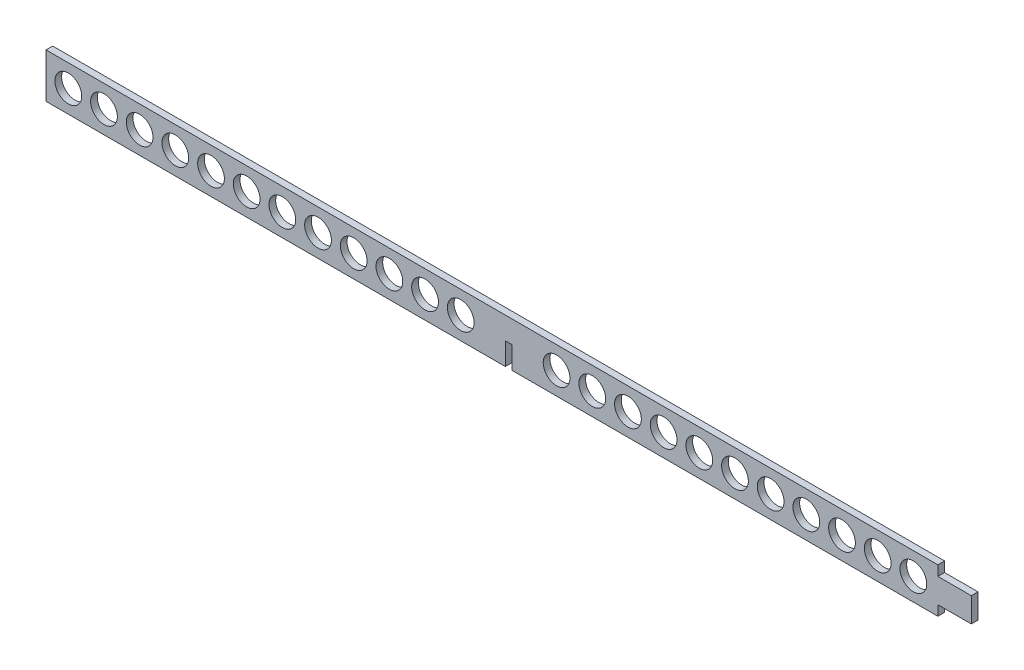
ISO-10303-21;
HEADER;
FILE_DESCRIPTION(('STEP AP214'),'2;1');
FILE_NAME('part.step','',(''),(''),'','','');
FILE_SCHEMA(('AUTOMOTIVE_DESIGN { 1 0 10303 214 1 1 1 1 }'));
ENDSEC;
DATA;
#1=APPLICATION_CONTEXT('core data for automotive mechanical design processes');
#2=APPLICATION_PROTOCOL_DEFINITION('international standard','automotive_design',2000,#1);
#3=PRODUCT_CONTEXT('',#1,'mechanical');
#4=PRODUCT('Part','Part','',(#3));
#5=PRODUCT_RELATED_PRODUCT_CATEGORY('part','',(#4));
#6=PRODUCT_DEFINITION_FORMATION('','',#4);
#7=PRODUCT_DEFINITION_CONTEXT('part definition',#1,'design');
#8=PRODUCT_DEFINITION('design','',#6,#7);
#9=PRODUCT_DEFINITION_SHAPE('','',#8);
#10=(LENGTH_UNIT() NAMED_UNIT(*) SI_UNIT(.MILLI.,.METRE.));
#11=(NAMED_UNIT(*) PLANE_ANGLE_UNIT() SI_UNIT($,.RADIAN.));
#12=(NAMED_UNIT(*) SI_UNIT($,.STERADIAN.) SOLID_ANGLE_UNIT());
#13=UNCERTAINTY_MEASURE_WITH_UNIT(LENGTH_MEASURE(1.E-05),#10,'distance_accuracy_value','');
#14=(GEOMETRIC_REPRESENTATION_CONTEXT(3) GLOBAL_UNCERTAINTY_ASSIGNED_CONTEXT((#13)) GLOBAL_UNIT_ASSIGNED_CONTEXT((#10,
#11,#12)) REPRESENTATION_CONTEXT('',''));
#15=CARTESIAN_POINT('',(0.,0.,0.));
#16=DIRECTION('',(0.,0.,1.));
#17=DIRECTION('',(1.,0.,0.));
#18=AXIS2_PLACEMENT_3D('',#15,#16,#17);
#19=CARTESIAN_POINT('',(0.,0.,3.));
#20=DIRECTION('',(0.,1.,0.));
#21=DIRECTION('',(-1.,0.,0.));
#22=AXIS2_PLACEMENT_3D('',#19,#20,#21);
#23=PLANE('',#22);
#24=DIRECTION('',(1.,0.,0.));
#25=VECTOR('',#24,1.);
#26=CARTESIAN_POINT('',(0.,0.,0.));
#27=LINE('',#26,#25);
#28=CARTESIAN_POINT('',(-415.,0.,0.));
#29=VERTEX_POINT('',#28);
#30=CARTESIAN_POINT('',(-209.,0.,0.));
#31=VERTEX_POINT('',#30);
#32=EDGE_CURVE('E176',#29,#31,#27,.T.);
#33=ORIENTED_EDGE('',*,*,#32,.T.);
#34=DIRECTION('',(0.,0.,1.));
#35=VECTOR('',#34,1.);
#36=CARTESIAN_POINT('',(-209.,0.,0.));
#37=LINE('',#36,#35);
#38=CARTESIAN_POINT('',(-209.,0.,3.));
#39=VERTEX_POINT('',#38);
#40=EDGE_CURVE('E313',#31,#39,#37,.T.);
#41=ORIENTED_EDGE('',*,*,#40,.T.);
#42=DIRECTION('',(1.,0.,0.));
#43=VECTOR('',#42,1.);
#44=CARTESIAN_POINT('',(0.,0.,3.));
#45=LINE('',#44,#43);
#46=CARTESIAN_POINT('',(-415.,0.,3.));
#47=VERTEX_POINT('',#46);
#48=EDGE_CURVE('E170',#47,#39,#45,.T.);
#49=ORIENTED_EDGE('',*,*,#48,.F.);
#50=DIRECTION('',(0.,0.,-1.));
#51=VECTOR('',#50,1.);
#52=CARTESIAN_POINT('',(-415.,0.,3.));
#53=LINE('',#52,#51);
#54=EDGE_CURVE('E52',#47,#29,#53,.T.);
#55=ORIENTED_EDGE('',*,*,#54,.T.);
#56=EDGE_LOOP('',(#33,#41,#49,#55));
#57=FACE_BOUND('',#56,.T.);
#58=ADVANCED_FACE('F43',(#57),#23,.F.);
#59=CARTESIAN_POINT('',(0.,0.,3.));
#60=DIRECTION('',(-1.,0.,0.));
#61=DIRECTION('',(0.,0.,1.));
#62=AXIS2_PLACEMENT_3D('',#59,#60,#61);
#63=PLANE('',#62);
#64=DIRECTION('',(0.,1.,0.));
#65=VECTOR('',#64,1.);
#66=CARTESIAN_POINT('',(0.,0.,0.));
#67=LINE('',#66,#65);
#68=CARTESIAN_POINT('',(0.,4.5,0.));
#69=VERTEX_POINT('',#68);
#70=CARTESIAN_POINT('',(0.,15.5,0.));
#71=VERTEX_POINT('',#70);
#72=EDGE_CURVE('E150',#69,#71,#67,.T.);
#73=ORIENTED_EDGE('',*,*,#72,.T.);
#74=DIRECTION('',(0.,0.,1.));
#75=VECTOR('',#74,1.);
#76=CARTESIAN_POINT('',(0.,15.5,0.));
#77=LINE('',#76,#75);
#78=CARTESIAN_POINT('',(0.,15.5,3.));
#79=VERTEX_POINT('',#78);
#80=EDGE_CURVE('E133',#71,#79,#77,.T.);
#81=ORIENTED_EDGE('',*,*,#80,.T.);
#82=DIRECTION('',(0.,1.,0.));
#83=VECTOR('',#82,1.);
#84=CARTESIAN_POINT('',(0.,0.,3.));
#85=LINE('',#84,#83);
#86=CARTESIAN_POINT('',(0.,4.5,3.));
#87=VERTEX_POINT('',#86);
#88=EDGE_CURVE('E179',#87,#79,#85,.T.);
#89=ORIENTED_EDGE('',*,*,#88,.F.);
#90=DIRECTION('',(0.,0.,1.));
#91=VECTOR('',#90,1.);
#92=CARTESIAN_POINT('',(0.,4.5,0.));
#93=LINE('',#92,#91);
#94=EDGE_CURVE('E157',#69,#87,#93,.T.);
#95=ORIENTED_EDGE('',*,*,#94,.F.);
#96=EDGE_LOOP('',(#73,#81,#89,#95));
#97=FACE_BOUND('',#96,.T.);
#98=ADVANCED_FACE('F45',(#97),#63,.F.);
#99=CARTESIAN_POINT('',(0.,20.,3.));
#100=DIRECTION('',(0.,-1.,0.));
#101=DIRECTION('',(1.,0.,0.));
#102=AXIS2_PLACEMENT_3D('',#99,#100,#101);
#103=PLANE('',#102);
#104=DIRECTION('',(-1.,0.,0.));
#105=VECTOR('',#104,1.);
#106=CARTESIAN_POINT('',(0.,20.,3.));
#107=LINE('',#106,#105);
#108=CARTESIAN_POINT('',(-15.,20.,3.));
#109=VERTEX_POINT('',#108);
#110=CARTESIAN_POINT('',(-415.,19.9999999999999,3.));
#111=VERTEX_POINT('',#110);
#112=EDGE_CURVE('E198',#109,#111,#107,.T.);
#113=ORIENTED_EDGE('',*,*,#112,.F.);
#114=DIRECTION('',(0.,0.,1.));
#115=VECTOR('',#114,1.);
#116=CARTESIAN_POINT('',(-15.,20.,0.));
#117=LINE('',#116,#115);
#118=CARTESIAN_POINT('',(-15.,20.,0.));
#119=VERTEX_POINT('',#118);
#120=EDGE_CURVE('E154',#119,#109,#117,.T.);
#121=ORIENTED_EDGE('',*,*,#120,.F.);
#122=DIRECTION('',(-1.,0.,0.));
#123=VECTOR('',#122,1.);
#124=CARTESIAN_POINT('',(0.,20.,0.));
#125=LINE('',#124,#123);
#126=CARTESIAN_POINT('',(-415.,19.9999999999999,0.));
#127=VERTEX_POINT('',#126);
#128=EDGE_CURVE('E159',#119,#127,#125,.T.);
#129=ORIENTED_EDGE('',*,*,#128,.T.);
#130=DIRECTION('',(0.,0.,-1.));
#131=VECTOR('',#130,1.);
#132=CARTESIAN_POINT('',(-415.,19.9999999999999,3.));
#133=LINE('',#132,#131);
#134=EDGE_CURVE('E11',#111,#127,#133,.T.);
#135=ORIENTED_EDGE('',*,*,#134,.F.);
#136=EDGE_LOOP('',(#113,#121,#129,#135));
#137=FACE_BOUND('',#136,.T.);
#138=ADVANCED_FACE('F475',(#137),#103,.F.);
#139=CARTESIAN_POINT('',(-415.,0.,3.));
#140=DIRECTION('',(1.,0.,0.));
#141=DIRECTION('',(0.,0.,-1.));
#142=AXIS2_PLACEMENT_3D('',#139,#140,#141);
#143=PLANE('',#142);
#144=DIRECTION('',(0.,-1.,0.));
#145=VECTOR('',#144,1.);
#146=CARTESIAN_POINT('',(-415.,0.,0.));
#147=LINE('',#146,#145);
#148=EDGE_CURVE('E164',#127,#29,#147,.T.);
#149=ORIENTED_EDGE('',*,*,#148,.T.);
#150=ORIENTED_EDGE('',*,*,#54,.F.);
#151=DIRECTION('',(0.,-1.,0.));
#152=VECTOR('',#151,1.);
#153=CARTESIAN_POINT('',(-415.,0.,3.));
#154=LINE('',#153,#152);
#155=EDGE_CURVE('E193',#111,#47,#154,.T.);
#156=ORIENTED_EDGE('',*,*,#155,.F.);
#157=ORIENTED_EDGE('',*,*,#134,.T.);
#158=EDGE_LOOP('',(#149,#150,#156,#157));
#159=FACE_BOUND('',#158,.T.);
#160=ADVANCED_FACE('F480',(#159),#143,.F.);
#161=CARTESIAN_POINT('',(-206.,0.,0.));
#162=VERTEX_POINT('',#161);
#163=CARTESIAN_POINT('',(-15.,0.,0.));
#164=VERTEX_POINT('',#163);
#165=EDGE_CURVE('E175',#162,#164,#27,.T.);
#166=ORIENTED_EDGE('',*,*,#165,.T.);
#167=DIRECTION('',(0.,0.,1.));
#168=VECTOR('',#167,1.);
#169=CARTESIAN_POINT('',(-15.,0.,0.));
#170=LINE('',#169,#168);
#171=CARTESIAN_POINT('',(-15.,0.,3.));
#172=VERTEX_POINT('',#171);
#173=EDGE_CURVE('E345',#164,#172,#170,.T.);
#174=ORIENTED_EDGE('',*,*,#173,.T.);
#175=CARTESIAN_POINT('',(-206.,0.,3.));
#176=VERTEX_POINT('',#175);
#177=EDGE_CURVE('E188',#176,#172,#45,.T.);
#178=ORIENTED_EDGE('',*,*,#177,.F.);
#179=DIRECTION('',(0.,0.,1.));
#180=VECTOR('',#179,1.);
#181=CARTESIAN_POINT('',(-206.,0.,0.));
#182=LINE('',#181,#180);
#183=EDGE_CURVE('E317',#162,#176,#182,.T.);
#184=ORIENTED_EDGE('',*,*,#183,.F.);
#185=EDGE_LOOP('',(#166,#174,#178,#184));
#186=FACE_BOUND('',#185,.T.);
#187=ADVANCED_FACE('F471',(#186),#23,.F.);
#188=CARTESIAN_POINT('',(0.,0.,3.));
#189=DIRECTION('',(0.,0.,1.));
#190=DIRECTION('',(1.,0.,0.));
#191=AXIS2_PLACEMENT_3D('',#188,#189,#190);
#192=PLANE('',#191);
#193=CARTESIAN_POINT('',(-42.,9.99999999999995,3.));
#194=DIRECTION('',(0.,0.,1.));
#195=DIRECTION('',(1.,0.,0.));
#196=AXIS2_PLACEMENT_3D('',#193,#194,#195);
#197=CIRCLE('',#196,5.99999999999999);
#198=CARTESIAN_POINT('',(-36.,9.99999999999995,3.));
#199=VERTEX_POINT('',#198);
#200=EDGE_CURVE('E160',#199,#199,#197,.T.);
#201=ORIENTED_EDGE('',*,*,#200,.F.);
#202=EDGE_LOOP('',(#201));
#203=FACE_BOUND('',#202,.T.);
#204=CARTESIAN_POINT('',(-26.,9.99999999999995,3.));
#205=DIRECTION('',(0.,0.,1.));
#206=DIRECTION('',(1.,0.,0.));
#207=AXIS2_PLACEMENT_3D('',#204,#205,#206);
#208=CIRCLE('',#207,5.99999999999999);
#209=CARTESIAN_POINT('',(-20.,9.99999999999995,3.));
#210=VERTEX_POINT('',#209);
#211=EDGE_CURVE('E167',#210,#210,#208,.T.);
#212=ORIENTED_EDGE('',*,*,#211,.F.);
#213=EDGE_LOOP('',(#212));
#214=FACE_BOUND('',#213,.T.);
#215=CARTESIAN_POINT('',(-229.,9.99999999999997,3.));
#216=DIRECTION('',(0.,0.,1.));
#217=DIRECTION('',(1.,0.,0.));
#218=AXIS2_PLACEMENT_3D('',#215,#216,#217);
#219=CIRCLE('',#218,5.99999999999999);
#220=CARTESIAN_POINT('',(-223.,9.99999999999997,3.));
#221=VERTEX_POINT('',#220);
#222=EDGE_CURVE('E208',#221,#221,#219,.T.);
#223=ORIENTED_EDGE('',*,*,#222,.F.);
#224=EDGE_LOOP('',(#223));
#225=FACE_BOUND('',#224,.T.);
#226=CARTESIAN_POINT('',(-245.,9.99999999999997,3.));
#227=DIRECTION('',(0.,0.,1.));
#228=DIRECTION('',(1.,0.,0.));
#229=AXIS2_PLACEMENT_3D('',#226,#227,#228);
#230=CIRCLE('',#229,5.99999999999999);
#231=CARTESIAN_POINT('',(-239.,9.99999999999997,3.));
#232=VERTEX_POINT('',#231);
#233=EDGE_CURVE('E212',#232,#232,#230,.T.);
#234=ORIENTED_EDGE('',*,*,#233,.F.);
#235=EDGE_LOOP('',(#234));
#236=FACE_BOUND('',#235,.T.);
#237=CARTESIAN_POINT('',(-261.,9.99999999999997,3.));
#238=DIRECTION('',(0.,0.,1.));
#239=DIRECTION('',(1.,0.,0.));
#240=AXIS2_PLACEMENT_3D('',#237,#238,#239);
#241=CIRCLE('',#240,5.99999999999999);
#242=CARTESIAN_POINT('',(-255.,9.99999999999997,3.));
#243=VERTEX_POINT('',#242);
#244=EDGE_CURVE('E216',#243,#243,#241,.T.);
#245=ORIENTED_EDGE('',*,*,#244,.F.);
#246=EDGE_LOOP('',(#245));
#247=FACE_BOUND('',#246,.T.);
#248=CARTESIAN_POINT('',(-277.,9.99999999999997,3.));
#249=DIRECTION('',(0.,0.,1.));
#250=DIRECTION('',(1.,0.,0.));
#251=AXIS2_PLACEMENT_3D('',#248,#249,#250);
#252=CIRCLE('',#251,5.99999999999999);
#253=CARTESIAN_POINT('',(-271.,9.99999999999997,3.));
#254=VERTEX_POINT('',#253);
#255=EDGE_CURVE('E220',#254,#254,#252,.T.);
#256=ORIENTED_EDGE('',*,*,#255,.F.);
#257=EDGE_LOOP('',(#256));
#258=FACE_BOUND('',#257,.T.);
#259=CARTESIAN_POINT('',(-293.,9.99999999999996,3.));
#260=DIRECTION('',(0.,0.,1.));
#261=DIRECTION('',(1.,0.,0.));
#262=AXIS2_PLACEMENT_3D('',#259,#260,#261);
#263=CIRCLE('',#262,5.99999999999999);
#264=CARTESIAN_POINT('',(-287.,9.99999999999996,3.));
#265=VERTEX_POINT('',#264);
#266=EDGE_CURVE('E224',#265,#265,#263,.T.);
#267=ORIENTED_EDGE('',*,*,#266,.F.);
#268=EDGE_LOOP('',(#267));
#269=FACE_BOUND('',#268,.T.);
#270=CARTESIAN_POINT('',(-309.,9.99999999999996,3.));
#271=DIRECTION('',(0.,0.,1.));
#272=DIRECTION('',(1.,0.,0.));
#273=AXIS2_PLACEMENT_3D('',#270,#271,#272);
#274=CIRCLE('',#273,5.99999999999999);
#275=CARTESIAN_POINT('',(-303.,9.99999999999996,3.));
#276=VERTEX_POINT('',#275);
#277=EDGE_CURVE('E228',#276,#276,#274,.T.);
#278=ORIENTED_EDGE('',*,*,#277,.F.);
#279=EDGE_LOOP('',(#278));
#280=FACE_BOUND('',#279,.T.);
#281=CARTESIAN_POINT('',(-389.,9.99999999999995,3.));
#282=DIRECTION('',(0.,0.,1.));
#283=DIRECTION('',(1.,0.,0.));
#284=AXIS2_PLACEMENT_3D('',#281,#282,#283);
#285=CIRCLE('',#284,5.99999999999999);
#286=CARTESIAN_POINT('',(-383.,9.99999999999995,3.));
#287=VERTEX_POINT('',#286);
#288=EDGE_CURVE('E232',#287,#287,#285,.T.);
#289=ORIENTED_EDGE('',*,*,#288,.F.);
#290=EDGE_LOOP('',(#289));
#291=FACE_BOUND('',#290,.T.);
#292=DIRECTION('',(1.,0.,0.));
#293=VECTOR('',#292,1.);
#294=CARTESIAN_POINT('',(0.,15.5,3.));
#295=LINE('',#294,#293);
#296=CARTESIAN_POINT('',(-15.,15.5,3.));
#297=VERTEX_POINT('',#296);
#298=EDGE_CURVE('E136',#297,#79,#295,.T.);
#299=ORIENTED_EDGE('',*,*,#298,.F.);
#300=DIRECTION('',(0.,-1.,0.));
#301=VECTOR('',#300,1.);
#302=CARTESIAN_POINT('',(-15.,0.,3.));
#303=LINE('',#302,#301);
#304=EDGE_CURVE('E238',#109,#297,#303,.T.);
#305=ORIENTED_EDGE('',*,*,#304,.F.);
#306=ORIENTED_EDGE('',*,*,#112,.T.);
#307=ORIENTED_EDGE('',*,*,#155,.T.);
#308=ORIENTED_EDGE('',*,*,#48,.T.);
#309=DIRECTION('',(0.,-1.,0.));
#310=VECTOR('',#309,1.);
#311=CARTESIAN_POINT('',(-209.,0.,3.));
#312=LINE('',#311,#310);
#313=CARTESIAN_POINT('',(-209.,9.99999999999997,3.));
#314=VERTEX_POINT('',#313);
#315=EDGE_CURVE('E303',#314,#39,#312,.T.);
#316=ORIENTED_EDGE('',*,*,#315,.F.);
#317=DIRECTION('',(-1.,0.,0.));
#318=VECTOR('',#317,1.);
#319=CARTESIAN_POINT('',(0.,9.99999999999997,3.));
#320=LINE('',#319,#318);
#321=CARTESIAN_POINT('',(-206.,9.99999999999997,3.));
#322=VERTEX_POINT('',#321);
#323=EDGE_CURVE('E306',#322,#314,#320,.T.);
#324=ORIENTED_EDGE('',*,*,#323,.F.);
#325=DIRECTION('',(0.,1.,0.));
#326=VECTOR('',#325,1.);
#327=CARTESIAN_POINT('',(-206.,0.,3.));
#328=LINE('',#327,#326);
#329=EDGE_CURVE('E309',#176,#322,#328,.T.);
#330=ORIENTED_EDGE('',*,*,#329,.F.);
#331=ORIENTED_EDGE('',*,*,#177,.T.);
#332=DIRECTION('',(0.,-1.,0.));
#333=VECTOR('',#332,1.);
#334=CARTESIAN_POINT('',(-15.,0.,3.));
#335=LINE('',#334,#333);
#336=CARTESIAN_POINT('',(-15.,4.5,3.));
#337=VERTEX_POINT('',#336);
#338=EDGE_CURVE('E241',#337,#172,#335,.T.);
#339=ORIENTED_EDGE('',*,*,#338,.F.);
#340=DIRECTION('',(-1.,0.,0.));
#341=VECTOR('',#340,1.);
#342=CARTESIAN_POINT('',(0.,4.5,3.));
#343=LINE('',#342,#341);
#344=EDGE_CURVE('E244',#87,#337,#343,.T.);
#345=ORIENTED_EDGE('',*,*,#344,.F.);
#346=ORIENTED_EDGE('',*,*,#88,.T.);
#347=EDGE_LOOP('',(#299,#305,#306,#307,#308,#316,#324,#330,#331,#339,#345,#346));
#348=FACE_BOUND('',#347,.T.);
#349=CARTESIAN_POINT('',(-405.,9.99999999999995,3.));
#350=DIRECTION('',(0.,0.,1.));
#351=DIRECTION('',(1.,0.,0.));
#352=AXIS2_PLACEMENT_3D('',#349,#350,#351);
#353=CIRCLE('',#352,5.99999999999999);
#354=CARTESIAN_POINT('',(-399.,9.99999999999995,3.));
#355=VERTEX_POINT('',#354);
#356=EDGE_CURVE('E247',#355,#355,#353,.T.);
#357=ORIENTED_EDGE('',*,*,#356,.F.);
#358=EDGE_LOOP('',(#357));
#359=FACE_BOUND('',#358,.T.);
#360=CARTESIAN_POINT('',(-373.,9.99999999999995,3.));
#361=DIRECTION('',(0.,0.,1.));
#362=DIRECTION('',(1.,0.,0.));
#363=AXIS2_PLACEMENT_3D('',#360,#361,#362);
#364=CIRCLE('',#363,5.99999999999999);
#365=CARTESIAN_POINT('',(-367.,9.99999999999995,3.));
#366=VERTEX_POINT('',#365);
#367=EDGE_CURVE('E251',#366,#366,#364,.T.);
#368=ORIENTED_EDGE('',*,*,#367,.F.);
#369=EDGE_LOOP('',(#368));
#370=FACE_BOUND('',#369,.T.);
#371=CARTESIAN_POINT('',(-357.,9.99999999999996,3.));
#372=DIRECTION('',(0.,0.,1.));
#373=DIRECTION('',(1.,0.,0.));
#374=AXIS2_PLACEMENT_3D('',#371,#372,#373);
#375=CIRCLE('',#374,5.99999999999999);
#376=CARTESIAN_POINT('',(-351.,9.99999999999996,3.));
#377=VERTEX_POINT('',#376);
#378=EDGE_CURVE('E255',#377,#377,#375,.T.);
#379=ORIENTED_EDGE('',*,*,#378,.F.);
#380=EDGE_LOOP('',(#379));
#381=FACE_BOUND('',#380,.T.);
#382=CARTESIAN_POINT('',(-341.,9.99999999999996,3.));
#383=DIRECTION('',(0.,0.,1.));
#384=DIRECTION('',(1.,0.,0.));
#385=AXIS2_PLACEMENT_3D('',#382,#383,#384);
#386=CIRCLE('',#385,5.99999999999999);
#387=CARTESIAN_POINT('',(-335.,9.99999999999996,3.));
#388=VERTEX_POINT('',#387);
#389=EDGE_CURVE('E259',#388,#388,#386,.T.);
#390=ORIENTED_EDGE('',*,*,#389,.F.);
#391=EDGE_LOOP('',(#390));
#392=FACE_BOUND('',#391,.T.);
#393=CARTESIAN_POINT('',(-325.,9.99999999999996,3.));
#394=DIRECTION('',(0.,0.,1.));
#395=DIRECTION('',(1.,0.,0.));
#396=AXIS2_PLACEMENT_3D('',#393,#394,#395);
#397=CIRCLE('',#396,5.99999999999999);
#398=CARTESIAN_POINT('',(-319.,9.99999999999996,3.));
#399=VERTEX_POINT('',#398);
#400=EDGE_CURVE('E263',#399,#399,#397,.T.);
#401=ORIENTED_EDGE('',*,*,#400,.F.);
#402=EDGE_LOOP('',(#401));
#403=FACE_BOUND('',#402,.T.);
#404=CARTESIAN_POINT('',(-58.,9.99999999999996,3.));
#405=DIRECTION('',(0.,0.,1.));
#406=DIRECTION('',(1.,0.,0.));
#407=AXIS2_PLACEMENT_3D('',#404,#405,#406);
#408=CIRCLE('',#407,5.99999999999999);
#409=CARTESIAN_POINT('',(-52.,9.99999999999996,3.));
#410=VERTEX_POINT('',#409);
#411=EDGE_CURVE('E267',#410,#410,#408,.T.);
#412=ORIENTED_EDGE('',*,*,#411,.F.);
#413=EDGE_LOOP('',(#412));
#414=FACE_BOUND('',#413,.T.);
#415=CARTESIAN_POINT('',(-74.,9.99999999999996,3.));
#416=DIRECTION('',(0.,0.,1.));
#417=DIRECTION('',(1.,0.,0.));
#418=AXIS2_PLACEMENT_3D('',#415,#416,#417);
#419=CIRCLE('',#418,5.99999999999999);
#420=CARTESIAN_POINT('',(-68.,9.99999999999996,3.));
#421=VERTEX_POINT('',#420);
#422=EDGE_CURVE('E271',#421,#421,#419,.T.);
#423=ORIENTED_EDGE('',*,*,#422,.F.);
#424=EDGE_LOOP('',(#423));
#425=FACE_BOUND('',#424,.T.);
#426=CARTESIAN_POINT('',(-90.,9.99999999999996,3.));
#427=DIRECTION('',(0.,0.,1.));
#428=DIRECTION('',(1.,0.,0.));
#429=AXIS2_PLACEMENT_3D('',#426,#427,#428);
#430=CIRCLE('',#429,5.99999999999999);
#431=CARTESIAN_POINT('',(-84.,9.99999999999996,3.));
#432=VERTEX_POINT('',#431);
#433=EDGE_CURVE('E275',#432,#432,#430,.T.);
#434=ORIENTED_EDGE('',*,*,#433,.F.);
#435=EDGE_LOOP('',(#434));
#436=FACE_BOUND('',#435,.T.);
#437=CARTESIAN_POINT('',(-106.,9.99999999999996,3.));
#438=DIRECTION('',(0.,0.,1.));
#439=DIRECTION('',(1.,0.,0.));
#440=AXIS2_PLACEMENT_3D('',#437,#438,#439);
#441=CIRCLE('',#440,5.99999999999999);
#442=CARTESIAN_POINT('',(-100.,9.99999999999996,3.));
#443=VERTEX_POINT('',#442);
#444=EDGE_CURVE('E279',#443,#443,#441,.T.);
#445=ORIENTED_EDGE('',*,*,#444,.F.);
#446=EDGE_LOOP('',(#445));
#447=FACE_BOUND('',#446,.T.);
#448=CARTESIAN_POINT('',(-122.,9.99999999999996,3.));
#449=DIRECTION('',(0.,0.,1.));
#450=DIRECTION('',(1.,0.,0.));
#451=AXIS2_PLACEMENT_3D('',#448,#449,#450);
#452=CIRCLE('',#451,5.99999999999999);
#453=CARTESIAN_POINT('',(-116.,9.99999999999996,3.));
#454=VERTEX_POINT('',#453);
#455=EDGE_CURVE('E283',#454,#454,#452,.T.);
#456=ORIENTED_EDGE('',*,*,#455,.F.);
#457=EDGE_LOOP('',(#456));
#458=FACE_BOUND('',#457,.T.);
#459=CARTESIAN_POINT('',(-138.,9.99999999999997,3.));
#460=DIRECTION('',(0.,0.,1.));
#461=DIRECTION('',(1.,0.,0.));
#462=AXIS2_PLACEMENT_3D('',#459,#460,#461);
#463=CIRCLE('',#462,5.99999999999999);
#464=CARTESIAN_POINT('',(-132.,9.99999999999997,3.));
#465=VERTEX_POINT('',#464);
#466=EDGE_CURVE('E287',#465,#465,#463,.T.);
#467=ORIENTED_EDGE('',*,*,#466,.F.);
#468=EDGE_LOOP('',(#467));
#469=FACE_BOUND('',#468,.T.);
#470=CARTESIAN_POINT('',(-154.,9.99999999999997,3.));
#471=DIRECTION('',(0.,0.,1.));
#472=DIRECTION('',(1.,0.,0.));
#473=AXIS2_PLACEMENT_3D('',#470,#471,#472);
#474=CIRCLE('',#473,5.99999999999999);
#475=CARTESIAN_POINT('',(-148.,9.99999999999997,3.));
#476=VERTEX_POINT('',#475);
#477=EDGE_CURVE('E291',#476,#476,#474,.T.);
#478=ORIENTED_EDGE('',*,*,#477,.F.);
#479=EDGE_LOOP('',(#478));
#480=FACE_BOUND('',#479,.T.);
#481=CARTESIAN_POINT('',(-170.,9.99999999999997,3.));
#482=DIRECTION('',(0.,0.,1.));
#483=DIRECTION('',(1.,0.,0.));
#484=AXIS2_PLACEMENT_3D('',#481,#482,#483);
#485=CIRCLE('',#484,5.99999999999999);
#486=CARTESIAN_POINT('',(-164.,9.99999999999997,3.));
#487=VERTEX_POINT('',#486);
#488=EDGE_CURVE('E295',#487,#487,#485,.T.);
#489=ORIENTED_EDGE('',*,*,#488,.F.);
#490=EDGE_LOOP('',(#489));
#491=FACE_BOUND('',#490,.T.);
#492=CARTESIAN_POINT('',(-186.,9.99999999999997,3.));
#493=DIRECTION('',(0.,0.,1.));
#494=DIRECTION('',(1.,0.,0.));
#495=AXIS2_PLACEMENT_3D('',#492,#493,#494);
#496=CIRCLE('',#495,5.99999999999999);
#497=CARTESIAN_POINT('',(-180.,9.99999999999997,3.));
#498=VERTEX_POINT('',#497);
#499=EDGE_CURVE('E299',#498,#498,#496,.T.);
#500=ORIENTED_EDGE('',*,*,#499,.F.);
#501=EDGE_LOOP('',(#500));
#502=FACE_BOUND('',#501,.T.);
#503=ADVANCED_FACE('F479',(#203,#214,#225,#236,#247,#258,#269,#280,#291,#348,#359,#370,#381,
#392,#403,#414,#425,#436,#447,#458,#469,#480,#491,#502),#192,.T.);
#504=CARTESIAN_POINT('',(0.,0.,0.));
#505=DIRECTION('',(0.,0.,1.));
#506=DIRECTION('',(1.,0.,0.));
#507=AXIS2_PLACEMENT_3D('',#504,#505,#506);
#508=PLANE('',#507);
#509=CARTESIAN_POINT('',(-42.,9.99999999999995,0.));
#510=DIRECTION('',(0.,0.,1.));
#511=DIRECTION('',(-1.,0.,0.));
#512=AXIS2_PLACEMENT_3D('',#509,#510,#511);
#513=CIRCLE('',#512,5.99999999999999);
#514=CARTESIAN_POINT('',(-48.,9.99999999999995,0.));
#515=VERTEX_POINT('',#514);
#516=EDGE_CURVE('E383',#515,#515,#513,.T.);
#517=ORIENTED_EDGE('',*,*,#516,.T.);
#518=EDGE_LOOP('',(#517));
#519=FACE_BOUND('',#518,.T.);
#520=CARTESIAN_POINT('',(-26.,9.99999999999995,0.));
#521=DIRECTION('',(0.,0.,1.));
#522=DIRECTION('',(-1.,0.,0.));
#523=AXIS2_PLACEMENT_3D('',#520,#521,#522);
#524=CIRCLE('',#523,5.99999999999999);
#525=CARTESIAN_POINT('',(-32.,9.99999999999995,0.));
#526=VERTEX_POINT('',#525);
#527=EDGE_CURVE('E387',#526,#526,#524,.T.);
#528=ORIENTED_EDGE('',*,*,#527,.T.);
#529=EDGE_LOOP('',(#528));
#530=FACE_BOUND('',#529,.T.);
#531=CARTESIAN_POINT('',(-229.,9.99999999999997,0.));
#532=DIRECTION('',(0.,0.,1.));
#533=DIRECTION('',(1.,0.,0.));
#534=AXIS2_PLACEMENT_3D('',#531,#532,#533);
#535=CIRCLE('',#534,5.99999999999999);
#536=CARTESIAN_POINT('',(-223.,9.99999999999997,0.));
#537=VERTEX_POINT('',#536);
#538=EDGE_CURVE('E392',#537,#537,#535,.T.);
#539=ORIENTED_EDGE('',*,*,#538,.T.);
#540=EDGE_LOOP('',(#539));
#541=FACE_BOUND('',#540,.T.);
#542=CARTESIAN_POINT('',(-245.,9.99999999999997,0.));
#543=DIRECTION('',(0.,0.,1.));
#544=DIRECTION('',(1.,0.,0.));
#545=AXIS2_PLACEMENT_3D('',#542,#543,#544);
#546=CIRCLE('',#545,5.99999999999999);
#547=CARTESIAN_POINT('',(-239.,9.99999999999997,0.));
#548=VERTEX_POINT('',#547);
#549=EDGE_CURVE('E396',#548,#548,#546,.T.);
#550=ORIENTED_EDGE('',*,*,#549,.T.);
#551=EDGE_LOOP('',(#550));
#552=FACE_BOUND('',#551,.T.);
#553=CARTESIAN_POINT('',(-261.,9.99999999999997,0.));
#554=DIRECTION('',(0.,0.,1.));
#555=DIRECTION('',(1.,0.,0.));
#556=AXIS2_PLACEMENT_3D('',#553,#554,#555);
#557=CIRCLE('',#556,5.99999999999999);
#558=CARTESIAN_POINT('',(-255.,9.99999999999997,0.));
#559=VERTEX_POINT('',#558);
#560=EDGE_CURVE('E400',#559,#559,#557,.T.);
#561=ORIENTED_EDGE('',*,*,#560,.T.);
#562=EDGE_LOOP('',(#561));
#563=FACE_BOUND('',#562,.T.);
#564=CARTESIAN_POINT('',(-277.,9.99999999999997,0.));
#565=DIRECTION('',(0.,0.,1.));
#566=DIRECTION('',(1.,0.,0.));
#567=AXIS2_PLACEMENT_3D('',#564,#565,#566);
#568=CIRCLE('',#567,5.99999999999999);
#569=CARTESIAN_POINT('',(-271.,9.99999999999997,0.));
#570=VERTEX_POINT('',#569);
#571=EDGE_CURVE('E404',#570,#570,#568,.T.);
#572=ORIENTED_EDGE('',*,*,#571,.T.);
#573=EDGE_LOOP('',(#572));
#574=FACE_BOUND('',#573,.T.);
#575=CARTESIAN_POINT('',(-293.,9.99999999999996,0.));
#576=DIRECTION('',(0.,0.,1.));
#577=DIRECTION('',(1.,0.,0.));
#578=AXIS2_PLACEMENT_3D('',#575,#576,#577);
#579=CIRCLE('',#578,5.99999999999999);
#580=CARTESIAN_POINT('',(-287.,9.99999999999996,0.));
#581=VERTEX_POINT('',#580);
#582=EDGE_CURVE('E408',#581,#581,#579,.T.);
#583=ORIENTED_EDGE('',*,*,#582,.T.);
#584=EDGE_LOOP('',(#583));
#585=FACE_BOUND('',#584,.T.);
#586=CARTESIAN_POINT('',(-309.,9.99999999999996,0.));
#587=DIRECTION('',(0.,0.,1.));
#588=DIRECTION('',(1.,0.,0.));
#589=AXIS2_PLACEMENT_3D('',#586,#587,#588);
#590=CIRCLE('',#589,5.99999999999999);
#591=CARTESIAN_POINT('',(-303.,9.99999999999996,0.));
#592=VERTEX_POINT('',#591);
#593=EDGE_CURVE('E372',#592,#592,#590,.T.);
#594=ORIENTED_EDGE('',*,*,#593,.T.);
#595=EDGE_LOOP('',(#594));
#596=FACE_BOUND('',#595,.T.);
#597=CARTESIAN_POINT('',(-389.,9.99999999999995,0.));
#598=DIRECTION('',(0.,0.,1.));
#599=DIRECTION('',(1.,0.,0.));
#600=AXIS2_PLACEMENT_3D('',#597,#598,#599);
#601=CIRCLE('',#600,5.99999999999999);
#602=CARTESIAN_POINT('',(-383.,9.99999999999995,0.));
#603=VERTEX_POINT('',#602);
#604=EDGE_CURVE('E143',#603,#603,#601,.T.);
#605=ORIENTED_EDGE('',*,*,#604,.T.);
#606=EDGE_LOOP('',(#605));
#607=FACE_BOUND('',#606,.T.);
#608=CARTESIAN_POINT('',(-405.,9.99999999999995,0.));
#609=DIRECTION('',(0.,0.,1.));
#610=DIRECTION('',(1.,0.,0.));
#611=AXIS2_PLACEMENT_3D('',#608,#609,#610);
#612=CIRCLE('',#611,5.99999999999999);
#613=CARTESIAN_POINT('',(-399.,9.99999999999995,0.));
#614=VERTEX_POINT('',#613);
#615=EDGE_CURVE('E339',#614,#614,#612,.T.);
#616=ORIENTED_EDGE('',*,*,#615,.T.);
#617=EDGE_LOOP('',(#616));
#618=FACE_BOUND('',#617,.T.);
#619=CARTESIAN_POINT('',(-373.,9.99999999999995,0.));
#620=DIRECTION('',(0.,0.,1.));
#621=DIRECTION('',(1.,0.,0.));
#622=AXIS2_PLACEMENT_3D('',#619,#620,#621);
#623=CIRCLE('',#622,5.99999999999999);
#624=CARTESIAN_POINT('',(-367.,9.99999999999995,0.));
#625=VERTEX_POINT('',#624);
#626=EDGE_CURVE('E360',#625,#625,#623,.T.);
#627=ORIENTED_EDGE('',*,*,#626,.T.);
#628=EDGE_LOOP('',(#627));
#629=FACE_BOUND('',#628,.T.);
#630=CARTESIAN_POINT('',(-357.,9.99999999999996,0.));
#631=DIRECTION('',(0.,0.,1.));
#632=DIRECTION('',(1.,0.,0.));
#633=AXIS2_PLACEMENT_3D('',#630,#631,#632);
#634=CIRCLE('',#633,5.99999999999999);
#635=CARTESIAN_POINT('',(-351.,9.99999999999996,0.));
#636=VERTEX_POINT('',#635);
#637=EDGE_CURVE('E376',#636,#636,#634,.T.);
#638=ORIENTED_EDGE('',*,*,#637,.T.);
#639=EDGE_LOOP('',(#638));
#640=FACE_BOUND('',#639,.T.);
#641=CARTESIAN_POINT('',(-341.,9.99999999999996,0.));
#642=DIRECTION('',(0.,0.,1.));
#643=DIRECTION('',(1.,0.,0.));
#644=AXIS2_PLACEMENT_3D('',#641,#642,#643);
#645=CIRCLE('',#644,5.99999999999999);
#646=CARTESIAN_POINT('',(-335.,9.99999999999996,0.));
#647=VERTEX_POINT('',#646);
#648=EDGE_CURVE('E371',#647,#647,#645,.T.);
#649=ORIENTED_EDGE('',*,*,#648,.T.);
#650=EDGE_LOOP('',(#649));
#651=FACE_BOUND('',#650,.T.);
#652=CARTESIAN_POINT('',(-325.,9.99999999999996,0.));
#653=DIRECTION('',(0.,0.,1.));
#654=DIRECTION('',(1.,0.,0.));
#655=AXIS2_PLACEMENT_3D('',#652,#653,#654);
#656=CIRCLE('',#655,5.99999999999999);
#657=CARTESIAN_POINT('',(-319.,9.99999999999996,0.));
#658=VERTEX_POINT('',#657);
#659=EDGE_CURVE('E367',#658,#658,#656,.T.);
#660=ORIENTED_EDGE('',*,*,#659,.T.);
#661=EDGE_LOOP('',(#660));
#662=FACE_BOUND('',#661,.T.);
#663=CARTESIAN_POINT('',(-58.,9.99999999999996,0.));
#664=DIRECTION('',(0.,0.,1.));
#665=DIRECTION('',(-1.,0.,0.));
#666=AXIS2_PLACEMENT_3D('',#663,#664,#665);
#667=CIRCLE('',#666,5.99999999999999);
#668=CARTESIAN_POINT('',(-64.,9.99999999999996,0.));
#669=VERTEX_POINT('',#668);
#670=EDGE_CURVE('E388',#669,#669,#667,.T.);
#671=ORIENTED_EDGE('',*,*,#670,.T.);
#672=EDGE_LOOP('',(#671));
#673=FACE_BOUND('',#672,.T.);
#674=CARTESIAN_POINT('',(-74.,9.99999999999996,0.));
#675=DIRECTION('',(0.,0.,1.));
#676=DIRECTION('',(-1.,0.,0.));
#677=AXIS2_PLACEMENT_3D('',#674,#675,#676);
#678=CIRCLE('',#677,5.99999999999999);
#679=CARTESIAN_POINT('',(-80.,9.99999999999996,0.));
#680=VERTEX_POINT('',#679);
#681=EDGE_CURVE('E443',#680,#680,#678,.T.);
#682=ORIENTED_EDGE('',*,*,#681,.T.);
#683=EDGE_LOOP('',(#682));
#684=FACE_BOUND('',#683,.T.);
#685=CARTESIAN_POINT('',(-90.,9.99999999999996,0.));
#686=DIRECTION('',(0.,0.,1.));
#687=DIRECTION('',(-1.,0.,0.));
#688=AXIS2_PLACEMENT_3D('',#685,#686,#687);
#689=CIRCLE('',#688,5.99999999999999);
#690=CARTESIAN_POINT('',(-96.,9.99999999999996,0.));
#691=VERTEX_POINT('',#690);
#692=EDGE_CURVE('E439',#691,#691,#689,.T.);
#693=ORIENTED_EDGE('',*,*,#692,.T.);
#694=EDGE_LOOP('',(#693));
#695=FACE_BOUND('',#694,.T.);
#696=CARTESIAN_POINT('',(-106.,9.99999999999996,0.));
#697=DIRECTION('',(0.,0.,1.));
#698=DIRECTION('',(-1.,0.,0.));
#699=AXIS2_PLACEMENT_3D('',#696,#697,#698);
#700=CIRCLE('',#699,5.99999999999999);
#701=CARTESIAN_POINT('',(-112.,9.99999999999996,0.));
#702=VERTEX_POINT('',#701);
#703=EDGE_CURVE('E435',#702,#702,#700,.T.);
#704=ORIENTED_EDGE('',*,*,#703,.T.);
#705=EDGE_LOOP('',(#704));
#706=FACE_BOUND('',#705,.T.);
#707=CARTESIAN_POINT('',(-122.,9.99999999999996,0.));
#708=DIRECTION('',(0.,0.,1.));
#709=DIRECTION('',(-1.,0.,0.));
#710=AXIS2_PLACEMENT_3D('',#707,#708,#709);
#711=CIRCLE('',#710,5.99999999999999);
#712=CARTESIAN_POINT('',(-128.,9.99999999999996,0.));
#713=VERTEX_POINT('',#712);
#714=EDGE_CURVE('E431',#713,#713,#711,.T.);
#715=ORIENTED_EDGE('',*,*,#714,.T.);
#716=EDGE_LOOP('',(#715));
#717=FACE_BOUND('',#716,.T.);
#718=CARTESIAN_POINT('',(-138.,9.99999999999997,0.));
#719=DIRECTION('',(0.,0.,1.));
#720=DIRECTION('',(-1.,0.,0.));
#721=AXIS2_PLACEMENT_3D('',#718,#719,#720);
#722=CIRCLE('',#721,5.99999999999999);
#723=CARTESIAN_POINT('',(-144.,9.99999999999997,0.));
#724=VERTEX_POINT('',#723);
#725=EDGE_CURVE('E427',#724,#724,#722,.T.);
#726=ORIENTED_EDGE('',*,*,#725,.T.);
#727=EDGE_LOOP('',(#726));
#728=FACE_BOUND('',#727,.T.);
#729=CARTESIAN_POINT('',(-154.,9.99999999999997,0.));
#730=DIRECTION('',(0.,0.,1.));
#731=DIRECTION('',(-1.,0.,0.));
#732=AXIS2_PLACEMENT_3D('',#729,#730,#731);
#733=CIRCLE('',#732,5.99999999999999);
#734=CARTESIAN_POINT('',(-160.,9.99999999999997,0.));
#735=VERTEX_POINT('',#734);
#736=EDGE_CURVE('E423',#735,#735,#733,.T.);
#737=ORIENTED_EDGE('',*,*,#736,.T.);
#738=EDGE_LOOP('',(#737));
#739=FACE_BOUND('',#738,.T.);
#740=CARTESIAN_POINT('',(-170.,9.99999999999997,0.));
#741=DIRECTION('',(0.,0.,1.));
#742=DIRECTION('',(-1.,0.,0.));
#743=AXIS2_PLACEMENT_3D('',#740,#741,#742);
#744=CIRCLE('',#743,5.99999999999999);
#745=CARTESIAN_POINT('',(-176.,9.99999999999997,0.));
#746=VERTEX_POINT('',#745);
#747=EDGE_CURVE('E419',#746,#746,#744,.T.);
#748=ORIENTED_EDGE('',*,*,#747,.T.);
#749=EDGE_LOOP('',(#748));
#750=FACE_BOUND('',#749,.T.);
#751=CARTESIAN_POINT('',(-186.,9.99999999999997,0.));
#752=DIRECTION('',(0.,0.,1.));
#753=DIRECTION('',(-1.,0.,0.));
#754=AXIS2_PLACEMENT_3D('',#751,#752,#753);
#755=CIRCLE('',#754,5.99999999999999);
#756=CARTESIAN_POINT('',(-192.,9.99999999999997,0.));
#757=VERTEX_POINT('',#756);
#758=EDGE_CURVE('E415',#757,#757,#755,.T.);
#759=ORIENTED_EDGE('',*,*,#758,.T.);
#760=EDGE_LOOP('',(#759));
#761=FACE_BOUND('',#760,.T.);
#762=DIRECTION('',(0.,-1.,0.));
#763=VECTOR('',#762,1.);
#764=CARTESIAN_POINT('',(-15.,15.5,0.));
#765=LINE('',#764,#763);
#766=CARTESIAN_POINT('',(-15.,15.5,0.));
#767=VERTEX_POINT('',#766);
#768=EDGE_CURVE('E152',#119,#767,#765,.T.);
#769=ORIENTED_EDGE('',*,*,#768,.T.);
#770=DIRECTION('',(1.,0.,0.));
#771=VECTOR('',#770,1.);
#772=CARTESIAN_POINT('',(0.,15.5,0.));
#773=LINE('',#772,#771);
#774=EDGE_CURVE('E59',#767,#71,#773,.T.);
#775=ORIENTED_EDGE('',*,*,#774,.T.);
#776=ORIENTED_EDGE('',*,*,#72,.F.);
#777=DIRECTION('',(-1.,0.,0.));
#778=VECTOR('',#777,1.);
#779=CARTESIAN_POINT('',(0.,4.5,0.));
#780=LINE('',#779,#778);
#781=CARTESIAN_POINT('',(-15.,4.5,0.));
#782=VERTEX_POINT('',#781);
#783=EDGE_CURVE('E342',#69,#782,#780,.T.);
#784=ORIENTED_EDGE('',*,*,#783,.T.);
#785=DIRECTION('',(0.,-1.,0.));
#786=VECTOR('',#785,1.);
#787=CARTESIAN_POINT('',(-15.,4.5,0.));
#788=LINE('',#787,#786);
#789=EDGE_CURVE('E67',#782,#164,#788,.T.);
#790=ORIENTED_EDGE('',*,*,#789,.T.);
#791=ORIENTED_EDGE('',*,*,#165,.F.);
#792=DIRECTION('',(0.,1.,0.));
#793=VECTOR('',#792,1.);
#794=CARTESIAN_POINT('',(-206.,9.99999999999997,0.));
#795=LINE('',#794,#793);
#796=CARTESIAN_POINT('',(-206.,9.99999999999997,0.));
#797=VERTEX_POINT('',#796);
#798=EDGE_CURVE('E331',#162,#797,#795,.T.);
#799=ORIENTED_EDGE('',*,*,#798,.T.);
#800=DIRECTION('',(-1.,0.,0.));
#801=VECTOR('',#800,1.);
#802=CARTESIAN_POINT('',(-209.,9.99999999999997,0.));
#803=LINE('',#802,#801);
#804=CARTESIAN_POINT('',(-209.,9.99999999999997,0.));
#805=VERTEX_POINT('',#804);
#806=EDGE_CURVE('E318',#797,#805,#803,.T.);
#807=ORIENTED_EDGE('',*,*,#806,.T.);
#808=DIRECTION('',(0.,-1.,0.));
#809=VECTOR('',#808,1.);
#810=CARTESIAN_POINT('',(-209.,9.99999999999997,0.));
#811=LINE('',#810,#809);
#812=EDGE_CURVE('E335',#805,#31,#811,.T.);
#813=ORIENTED_EDGE('',*,*,#812,.T.);
#814=ORIENTED_EDGE('',*,*,#32,.F.);
#815=ORIENTED_EDGE('',*,*,#148,.F.);
#816=ORIENTED_EDGE('',*,*,#128,.F.);
#817=EDGE_LOOP('',(#769,#775,#776,#784,#790,#791,#799,#807,#813,#814,#815,#816));
#818=FACE_BOUND('',#817,.T.);
#819=ADVANCED_FACE('F148',(#519,#530,#541,#552,#563,#574,#585,#596,#607,#618,#629,#640,#651,
#662,#673,#684,#695,#706,#717,#728,#739,#750,#761,#818),#508,.F.);
#820=CARTESIAN_POINT('',(-209.,9.99999999999997,0.));
#821=DIRECTION('',(-1.,0.,0.));
#822=DIRECTION('',(0.,0.,1.));
#823=AXIS2_PLACEMENT_3D('',#820,#821,#822);
#824=PLANE('',#823);
#825=ORIENTED_EDGE('',*,*,#315,.T.);
#826=ORIENTED_EDGE('',*,*,#40,.F.);
#827=ORIENTED_EDGE('',*,*,#812,.F.);
#828=DIRECTION('',(0.,0.,1.));
#829=VECTOR('',#828,1.);
#830=CARTESIAN_POINT('',(-209.,9.99999999999997,0.));
#831=LINE('',#830,#829);
#832=EDGE_CURVE('E312',#805,#314,#831,.T.);
#833=ORIENTED_EDGE('',*,*,#832,.T.);
#834=EDGE_LOOP('',(#825,#826,#827,#833));
#835=FACE_BOUND('',#834,.T.);
#836=ADVANCED_FACE('F507',(#835),#824,.F.);
#837=CARTESIAN_POINT('',(-209.,9.99999999999997,0.));
#838=DIRECTION('',(0.,1.,0.));
#839=DIRECTION('',(0.,0.,1.));
#840=AXIS2_PLACEMENT_3D('',#837,#838,#839);
#841=PLANE('',#840);
#842=ORIENTED_EDGE('',*,*,#323,.T.);
#843=ORIENTED_EDGE('',*,*,#832,.F.);
#844=ORIENTED_EDGE('',*,*,#806,.F.);
#845=DIRECTION('',(0.,0.,1.));
#846=VECTOR('',#845,1.);
#847=CARTESIAN_POINT('',(-206.,9.99999999999997,0.));
#848=LINE('',#847,#846);
#849=EDGE_CURVE('E321',#797,#322,#848,.T.);
#850=ORIENTED_EDGE('',*,*,#849,.T.);
#851=EDGE_LOOP('',(#842,#843,#844,#850));
#852=FACE_BOUND('',#851,.T.);
#853=ADVANCED_FACE('F510',(#852),#841,.F.);
#854=CARTESIAN_POINT('',(-206.,9.99999999999997,0.));
#855=DIRECTION('',(1.,0.,0.));
#856=DIRECTION('',(0.,0.,-1.));
#857=AXIS2_PLACEMENT_3D('',#854,#855,#856);
#858=PLANE('',#857);
#859=ORIENTED_EDGE('',*,*,#329,.T.);
#860=ORIENTED_EDGE('',*,*,#849,.F.);
#861=ORIENTED_EDGE('',*,*,#798,.F.);
#862=ORIENTED_EDGE('',*,*,#183,.T.);
#863=EDGE_LOOP('',(#859,#860,#861,#862));
#864=FACE_BOUND('',#863,.T.);
#865=ADVANCED_FACE('F513',(#864),#858,.F.);
#866=CARTESIAN_POINT('',(-186.,9.99999999999997,0.));
#867=DIRECTION('',(0.,0.,1.));
#868=DIRECTION('',(1.,0.,0.));
#869=AXIS2_PLACEMENT_3D('',#866,#867,#868);
#870=CYLINDRICAL_SURFACE('',#869,5.99999999999999);
#871=ORIENTED_EDGE('',*,*,#499,.T.);
#872=EDGE_LOOP('',(#871));
#873=FACE_BOUND('',#872,.T.);
#874=ORIENTED_EDGE('',*,*,#758,.F.);
#875=EDGE_LOOP('',(#874));
#876=FACE_BOUND('',#875,.T.);
#877=ADVANCED_FACE('F515',(#873,#876),#870,.F.);
#878=CARTESIAN_POINT('',(-170.,9.99999999999997,0.));
#879=DIRECTION('',(0.,0.,1.));
#880=DIRECTION('',(1.,0.,0.));
#881=AXIS2_PLACEMENT_3D('',#878,#879,#880);
#882=CYLINDRICAL_SURFACE('',#881,5.99999999999999);
#883=ORIENTED_EDGE('',*,*,#488,.T.);
#884=EDGE_LOOP('',(#883));
#885=FACE_BOUND('',#884,.T.);
#886=ORIENTED_EDGE('',*,*,#747,.F.);
#887=EDGE_LOOP('',(#886));
#888=FACE_BOUND('',#887,.T.);
#889=ADVANCED_FACE('F521',(#885,#888),#882,.F.);
#890=CARTESIAN_POINT('',(-154.,9.99999999999997,0.));
#891=DIRECTION('',(0.,0.,1.));
#892=DIRECTION('',(1.,0.,0.));
#893=AXIS2_PLACEMENT_3D('',#890,#891,#892);
#894=CYLINDRICAL_SURFACE('',#893,5.99999999999999);
#895=ORIENTED_EDGE('',*,*,#477,.T.);
#896=EDGE_LOOP('',(#895));
#897=FACE_BOUND('',#896,.T.);
#898=ORIENTED_EDGE('',*,*,#736,.F.);
#899=EDGE_LOOP('',(#898));
#900=FACE_BOUND('',#899,.T.);
#901=ADVANCED_FACE('F813',(#897,#900),#894,.F.);
#902=CARTESIAN_POINT('',(-138.,9.99999999999997,0.));
#903=DIRECTION('',(0.,0.,1.));
#904=DIRECTION('',(1.,0.,0.));
#905=AXIS2_PLACEMENT_3D('',#902,#903,#904);
#906=CYLINDRICAL_SURFACE('',#905,5.99999999999999);
#907=ORIENTED_EDGE('',*,*,#466,.T.);
#908=EDGE_LOOP('',(#907));
#909=FACE_BOUND('',#908,.T.);
#910=ORIENTED_EDGE('',*,*,#725,.F.);
#911=EDGE_LOOP('',(#910));
#912=FACE_BOUND('',#911,.T.);
#913=ADVANCED_FACE('F802',(#909,#912),#906,.F.);
#914=CARTESIAN_POINT('',(-122.,9.99999999999996,0.));
#915=DIRECTION('',(0.,0.,1.));
#916=DIRECTION('',(1.,0.,0.));
#917=AXIS2_PLACEMENT_3D('',#914,#915,#916);
#918=CYLINDRICAL_SURFACE('',#917,5.99999999999999);
#919=ORIENTED_EDGE('',*,*,#455,.T.);
#920=EDGE_LOOP('',(#919));
#921=FACE_BOUND('',#920,.T.);
#922=ORIENTED_EDGE('',*,*,#714,.F.);
#923=EDGE_LOOP('',(#922));
#924=FACE_BOUND('',#923,.T.);
#925=ADVANCED_FACE('F791',(#921,#924),#918,.F.);
#926=CARTESIAN_POINT('',(-106.,9.99999999999996,0.));
#927=DIRECTION('',(0.,0.,1.));
#928=DIRECTION('',(1.,0.,0.));
#929=AXIS2_PLACEMENT_3D('',#926,#927,#928);
#930=CYLINDRICAL_SURFACE('',#929,5.99999999999999);
#931=ORIENTED_EDGE('',*,*,#444,.T.);
#932=EDGE_LOOP('',(#931));
#933=FACE_BOUND('',#932,.T.);
#934=ORIENTED_EDGE('',*,*,#703,.F.);
#935=EDGE_LOOP('',(#934));
#936=FACE_BOUND('',#935,.T.);
#937=ADVANCED_FACE('F780',(#933,#936),#930,.F.);
#938=CARTESIAN_POINT('',(-90.,9.99999999999996,0.));
#939=DIRECTION('',(0.,0.,1.));
#940=DIRECTION('',(1.,0.,0.));
#941=AXIS2_PLACEMENT_3D('',#938,#939,#940);
#942=CYLINDRICAL_SURFACE('',#941,5.99999999999999);
#943=ORIENTED_EDGE('',*,*,#433,.T.);
#944=EDGE_LOOP('',(#943));
#945=FACE_BOUND('',#944,.T.);
#946=ORIENTED_EDGE('',*,*,#692,.F.);
#947=EDGE_LOOP('',(#946));
#948=FACE_BOUND('',#947,.T.);
#949=ADVANCED_FACE('F466',(#945,#948),#942,.F.);
#950=CARTESIAN_POINT('',(-74.,9.99999999999996,0.));
#951=DIRECTION('',(0.,0.,1.));
#952=DIRECTION('',(1.,0.,0.));
#953=AXIS2_PLACEMENT_3D('',#950,#951,#952);
#954=CYLINDRICAL_SURFACE('',#953,5.99999999999999);
#955=ORIENTED_EDGE('',*,*,#422,.T.);
#956=EDGE_LOOP('',(#955));
#957=FACE_BOUND('',#956,.T.);
#958=ORIENTED_EDGE('',*,*,#681,.F.);
#959=EDGE_LOOP('',(#958));
#960=FACE_BOUND('',#959,.T.);
#961=ADVANCED_FACE('F456',(#957,#960),#954,.F.);
#962=CARTESIAN_POINT('',(-58.,9.99999999999996,0.));
#963=DIRECTION('',(0.,0.,1.));
#964=DIRECTION('',(1.,0.,0.));
#965=AXIS2_PLACEMENT_3D('',#962,#963,#964);
#966=CYLINDRICAL_SURFACE('',#965,5.99999999999999);
#967=ORIENTED_EDGE('',*,*,#411,.T.);
#968=EDGE_LOOP('',(#967));
#969=FACE_BOUND('',#968,.T.);
#970=ORIENTED_EDGE('',*,*,#670,.F.);
#971=EDGE_LOOP('',(#970));
#972=FACE_BOUND('',#971,.T.);
#973=ADVANCED_FACE('F453',(#969,#972),#966,.F.);
#974=CARTESIAN_POINT('',(-325.,9.99999999999996,0.));
#975=DIRECTION('',(0.,0.,1.));
#976=DIRECTION('',(1.,0.,0.));
#977=AXIS2_PLACEMENT_3D('',#974,#975,#976);
#978=CYLINDRICAL_SURFACE('',#977,5.99999999999999);
#979=ORIENTED_EDGE('',*,*,#400,.T.);
#980=EDGE_LOOP('',(#979));
#981=FACE_BOUND('',#980,.T.);
#982=ORIENTED_EDGE('',*,*,#659,.F.);
#983=EDGE_LOOP('',(#982));
#984=FACE_BOUND('',#983,.T.);
#985=ADVANCED_FACE('F455',(#981,#984),#978,.F.);
#986=CARTESIAN_POINT('',(-341.,9.99999999999996,0.));
#987=DIRECTION('',(0.,0.,1.));
#988=DIRECTION('',(1.,0.,0.));
#989=AXIS2_PLACEMENT_3D('',#986,#987,#988);
#990=CYLINDRICAL_SURFACE('',#989,5.99999999999999);
#991=ORIENTED_EDGE('',*,*,#389,.T.);
#992=EDGE_LOOP('',(#991));
#993=FACE_BOUND('',#992,.T.);
#994=ORIENTED_EDGE('',*,*,#648,.F.);
#995=EDGE_LOOP('',(#994));
#996=FACE_BOUND('',#995,.T.);
#997=ADVANCED_FACE('F463',(#993,#996),#990,.F.);
#998=CARTESIAN_POINT('',(-357.,9.99999999999996,0.));
#999=DIRECTION('',(0.,0.,1.));
#1000=DIRECTION('',(1.,0.,0.));
#1001=AXIS2_PLACEMENT_3D('',#998,#999,#1000);
#1002=CYLINDRICAL_SURFACE('',#1001,5.99999999999999);
#1003=ORIENTED_EDGE('',*,*,#378,.T.);
#1004=EDGE_LOOP('',(#1003));
#1005=FACE_BOUND('',#1004,.T.);
#1006=ORIENTED_EDGE('',*,*,#637,.F.);
#1007=EDGE_LOOP('',(#1006));
#1008=FACE_BOUND('',#1007,.T.);
#1009=ADVANCED_FACE('F562',(#1005,#1008),#1002,.F.);
#1010=CARTESIAN_POINT('',(-373.,9.99999999999995,0.));
#1011=DIRECTION('',(0.,0.,1.));
#1012=DIRECTION('',(1.,0.,0.));
#1013=AXIS2_PLACEMENT_3D('',#1010,#1011,#1012);
#1014=CYLINDRICAL_SURFACE('',#1013,5.99999999999999);
#1015=ORIENTED_EDGE('',*,*,#367,.T.);
#1016=EDGE_LOOP('',(#1015));
#1017=FACE_BOUND('',#1016,.T.);
#1018=ORIENTED_EDGE('',*,*,#626,.F.);
#1019=EDGE_LOOP('',(#1018));
#1020=FACE_BOUND('',#1019,.T.);
#1021=ADVANCED_FACE('F568',(#1017,#1020),#1014,.F.);
#1022=CARTESIAN_POINT('',(-405.,9.99999999999995,0.));
#1023=DIRECTION('',(0.,0.,1.));
#1024=DIRECTION('',(1.,0.,0.));
#1025=AXIS2_PLACEMENT_3D('',#1022,#1023,#1024);
#1026=CYLINDRICAL_SURFACE('',#1025,5.99999999999999);
#1027=ORIENTED_EDGE('',*,*,#356,.T.);
#1028=EDGE_LOOP('',(#1027));
#1029=FACE_BOUND('',#1028,.T.);
#1030=ORIENTED_EDGE('',*,*,#615,.F.);
#1031=EDGE_LOOP('',(#1030));
#1032=FACE_BOUND('',#1031,.T.);
#1033=ADVANCED_FACE('F583',(#1029,#1032),#1026,.F.);
#1034=CARTESIAN_POINT('',(-15.,4.5,0.));
#1035=DIRECTION('',(-1.,0.,0.));
#1036=DIRECTION('',(0.,0.,1.));
#1037=AXIS2_PLACEMENT_3D('',#1034,#1035,#1036);
#1038=PLANE('',#1037);
#1039=ORIENTED_EDGE('',*,*,#338,.T.);
#1040=ORIENTED_EDGE('',*,*,#173,.F.);
#1041=ORIENTED_EDGE('',*,*,#789,.F.);
#1042=DIRECTION('',(0.,0.,1.));
#1043=VECTOR('',#1042,1.);
#1044=CARTESIAN_POINT('',(-15.,4.5,0.));
#1045=LINE('',#1044,#1043);
#1046=EDGE_CURVE('E346',#782,#337,#1045,.T.);
#1047=ORIENTED_EDGE('',*,*,#1046,.T.);
#1048=EDGE_LOOP('',(#1039,#1040,#1041,#1047));
#1049=FACE_BOUND('',#1048,.T.);
#1050=ADVANCED_FACE('F496',(#1049),#1038,.F.);
#1051=CARTESIAN_POINT('',(0.,4.5,0.));
#1052=DIRECTION('',(0.,1.,0.));
#1053=DIRECTION('',(-1.,0.,0.));
#1054=AXIS2_PLACEMENT_3D('',#1051,#1052,#1053);
#1055=PLANE('',#1054);
#1056=ORIENTED_EDGE('',*,*,#344,.T.);
#1057=ORIENTED_EDGE('',*,*,#1046,.F.);
#1058=ORIENTED_EDGE('',*,*,#783,.F.);
#1059=ORIENTED_EDGE('',*,*,#94,.T.);
#1060=EDGE_LOOP('',(#1056,#1057,#1058,#1059));
#1061=FACE_BOUND('',#1060,.T.);
#1062=ADVANCED_FACE('F494',(#1061),#1055,.F.);
#1063=CARTESIAN_POINT('',(0.,15.5,0.));
#1064=DIRECTION('',(0.,-1.,0.));
#1065=DIRECTION('',(1.,0.,0.));
#1066=AXIS2_PLACEMENT_3D('',#1063,#1064,#1065);
#1067=PLANE('',#1066);
#1068=ORIENTED_EDGE('',*,*,#298,.T.);
#1069=ORIENTED_EDGE('',*,*,#80,.F.);
#1070=ORIENTED_EDGE('',*,*,#774,.F.);
#1071=DIRECTION('',(0.,0.,1.));
#1072=VECTOR('',#1071,1.);
#1073=CARTESIAN_POINT('',(-15.,15.5,0.));
#1074=LINE('',#1073,#1072);
#1075=EDGE_CURVE('E142',#767,#297,#1074,.T.);
#1076=ORIENTED_EDGE('',*,*,#1075,.T.);
#1077=EDGE_LOOP('',(#1068,#1069,#1070,#1076));
#1078=FACE_BOUND('',#1077,.T.);
#1079=ADVANCED_FACE('F134',(#1078),#1067,.F.);
#1080=CARTESIAN_POINT('',(-15.,15.5,0.));
#1081=DIRECTION('',(-1.,0.,0.));
#1082=DIRECTION('',(0.,-1.,0.));
#1083=AXIS2_PLACEMENT_3D('',#1080,#1081,#1082);
#1084=PLANE('',#1083);
#1085=ORIENTED_EDGE('',*,*,#304,.T.);
#1086=ORIENTED_EDGE('',*,*,#1075,.F.);
#1087=ORIENTED_EDGE('',*,*,#768,.F.);
#1088=ORIENTED_EDGE('',*,*,#120,.T.);
#1089=EDGE_LOOP('',(#1085,#1086,#1087,#1088));
#1090=FACE_BOUND('',#1089,.T.);
#1091=ADVANCED_FACE('F573',(#1090),#1084,.F.);
#1092=CARTESIAN_POINT('',(-389.,9.99999999999995,0.));
#1093=DIRECTION('',(0.,0.,1.));
#1094=DIRECTION('',(1.,0.,0.));
#1095=AXIS2_PLACEMENT_3D('',#1092,#1093,#1094);
#1096=CYLINDRICAL_SURFACE('',#1095,5.99999999999999);
#1097=ORIENTED_EDGE('',*,*,#288,.T.);
#1098=EDGE_LOOP('',(#1097));
#1099=FACE_BOUND('',#1098,.T.);
#1100=ORIENTED_EDGE('',*,*,#604,.F.);
#1101=EDGE_LOOP('',(#1100));
#1102=FACE_BOUND('',#1101,.T.);
#1103=ADVANCED_FACE('F576',(#1099,#1102),#1096,.F.);
#1104=CARTESIAN_POINT('',(-309.,9.99999999999996,0.));
#1105=DIRECTION('',(0.,0.,1.));
#1106=DIRECTION('',(1.,0.,0.));
#1107=AXIS2_PLACEMENT_3D('',#1104,#1105,#1106);
#1108=CYLINDRICAL_SURFACE('',#1107,5.99999999999999);
#1109=ORIENTED_EDGE('',*,*,#277,.T.);
#1110=EDGE_LOOP('',(#1109));
#1111=FACE_BOUND('',#1110,.T.);
#1112=ORIENTED_EDGE('',*,*,#593,.F.);
#1113=EDGE_LOOP('',(#1112));
#1114=FACE_BOUND('',#1113,.T.);
#1115=ADVANCED_FACE('F581',(#1111,#1114),#1108,.F.);
#1116=CARTESIAN_POINT('',(-293.,9.99999999999996,0.));
#1117=DIRECTION('',(0.,0.,1.));
#1118=DIRECTION('',(1.,0.,0.));
#1119=AXIS2_PLACEMENT_3D('',#1116,#1117,#1118);
#1120=CYLINDRICAL_SURFACE('',#1119,5.99999999999999);
#1121=ORIENTED_EDGE('',*,*,#266,.T.);
#1122=EDGE_LOOP('',(#1121));
#1123=FACE_BOUND('',#1122,.T.);
#1124=ORIENTED_EDGE('',*,*,#582,.F.);
#1125=EDGE_LOOP('',(#1124));
#1126=FACE_BOUND('',#1125,.T.);
#1127=ADVANCED_FACE('F611',(#1123,#1126),#1120,.F.);
#1128=CARTESIAN_POINT('',(-277.,9.99999999999997,0.));
#1129=DIRECTION('',(0.,0.,1.));
#1130=DIRECTION('',(1.,0.,0.));
#1131=AXIS2_PLACEMENT_3D('',#1128,#1129,#1130);
#1132=CYLINDRICAL_SURFACE('',#1131,5.99999999999999);
#1133=ORIENTED_EDGE('',*,*,#255,.T.);
#1134=EDGE_LOOP('',(#1133));
#1135=FACE_BOUND('',#1134,.T.);
#1136=ORIENTED_EDGE('',*,*,#571,.F.);
#1137=EDGE_LOOP('',(#1136));
#1138=FACE_BOUND('',#1137,.T.);
#1139=ADVANCED_FACE('F619',(#1135,#1138),#1132,.F.);
#1140=CARTESIAN_POINT('',(-261.,9.99999999999997,0.));
#1141=DIRECTION('',(0.,0.,1.));
#1142=DIRECTION('',(1.,0.,0.));
#1143=AXIS2_PLACEMENT_3D('',#1140,#1141,#1142);
#1144=CYLINDRICAL_SURFACE('',#1143,5.99999999999999);
#1145=ORIENTED_EDGE('',*,*,#244,.T.);
#1146=EDGE_LOOP('',(#1145));
#1147=FACE_BOUND('',#1146,.T.);
#1148=ORIENTED_EDGE('',*,*,#560,.F.);
#1149=EDGE_LOOP('',(#1148));
#1150=FACE_BOUND('',#1149,.T.);
#1151=ADVANCED_FACE('F627',(#1147,#1150),#1144,.F.);
#1152=CARTESIAN_POINT('',(-245.,9.99999999999997,0.));
#1153=DIRECTION('',(0.,0.,1.));
#1154=DIRECTION('',(1.,0.,0.));
#1155=AXIS2_PLACEMENT_3D('',#1152,#1153,#1154);
#1156=CYLINDRICAL_SURFACE('',#1155,5.99999999999999);
#1157=ORIENTED_EDGE('',*,*,#233,.T.);
#1158=EDGE_LOOP('',(#1157));
#1159=FACE_BOUND('',#1158,.T.);
#1160=ORIENTED_EDGE('',*,*,#549,.F.);
#1161=EDGE_LOOP('',(#1160));
#1162=FACE_BOUND('',#1161,.T.);
#1163=ADVANCED_FACE('F635',(#1159,#1162),#1156,.F.);
#1164=CARTESIAN_POINT('',(-229.,9.99999999999997,0.));
#1165=DIRECTION('',(0.,0.,1.));
#1166=DIRECTION('',(1.,0.,0.));
#1167=AXIS2_PLACEMENT_3D('',#1164,#1165,#1166);
#1168=CYLINDRICAL_SURFACE('',#1167,5.99999999999999);
#1169=ORIENTED_EDGE('',*,*,#222,.T.);
#1170=EDGE_LOOP('',(#1169));
#1171=FACE_BOUND('',#1170,.T.);
#1172=ORIENTED_EDGE('',*,*,#538,.F.);
#1173=EDGE_LOOP('',(#1172));
#1174=FACE_BOUND('',#1173,.T.);
#1175=ADVANCED_FACE('F643',(#1171,#1174),#1168,.F.);
#1176=CARTESIAN_POINT('',(-26.,9.99999999999995,0.));
#1177=DIRECTION('',(0.,0.,1.));
#1178=DIRECTION('',(1.,0.,0.));
#1179=AXIS2_PLACEMENT_3D('',#1176,#1177,#1178);
#1180=CYLINDRICAL_SURFACE('',#1179,5.99999999999999);
#1181=ORIENTED_EDGE('',*,*,#211,.T.);
#1182=EDGE_LOOP('',(#1181));
#1183=FACE_BOUND('',#1182,.T.);
#1184=ORIENTED_EDGE('',*,*,#527,.F.);
#1185=EDGE_LOOP('',(#1184));
#1186=FACE_BOUND('',#1185,.T.);
#1187=ADVANCED_FACE('F651',(#1183,#1186),#1180,.F.);
#1188=CARTESIAN_POINT('',(-42.,9.99999999999995,0.));
#1189=DIRECTION('',(0.,0.,1.));
#1190=DIRECTION('',(1.,0.,0.));
#1191=AXIS2_PLACEMENT_3D('',#1188,#1189,#1190);
#1192=CYLINDRICAL_SURFACE('',#1191,5.99999999999999);
#1193=ORIENTED_EDGE('',*,*,#200,.T.);
#1194=EDGE_LOOP('',(#1193));
#1195=FACE_BOUND('',#1194,.T.);
#1196=ORIENTED_EDGE('',*,*,#516,.F.);
#1197=EDGE_LOOP('',(#1196));
#1198=FACE_BOUND('',#1197,.T.);
#1199=ADVANCED_FACE('F659',(#1195,#1198),#1192,.F.);
#1200=CLOSED_SHELL('',(#58,#98,#138,#160,#187,#503,#819,#836,#853,#865,#877,#889,#901,#913,#925,
#937,#949,#961,#973,#985,#997,#1009,#1021,#1033,#1050,#1062,#1079,#1091,#1103,#1115,#1127,#1139,
#1151,#1163,#1175,#1187,#1199));
#1201=MANIFOLD_SOLID_BREP('B2',#1200);
#1202=ADVANCED_BREP_SHAPE_REPRESENTATION('',(#18,#1201),#14);
#1203=SHAPE_DEFINITION_REPRESENTATION(#9,#1202);
ENDSEC;
END-ISO-10303-21;
